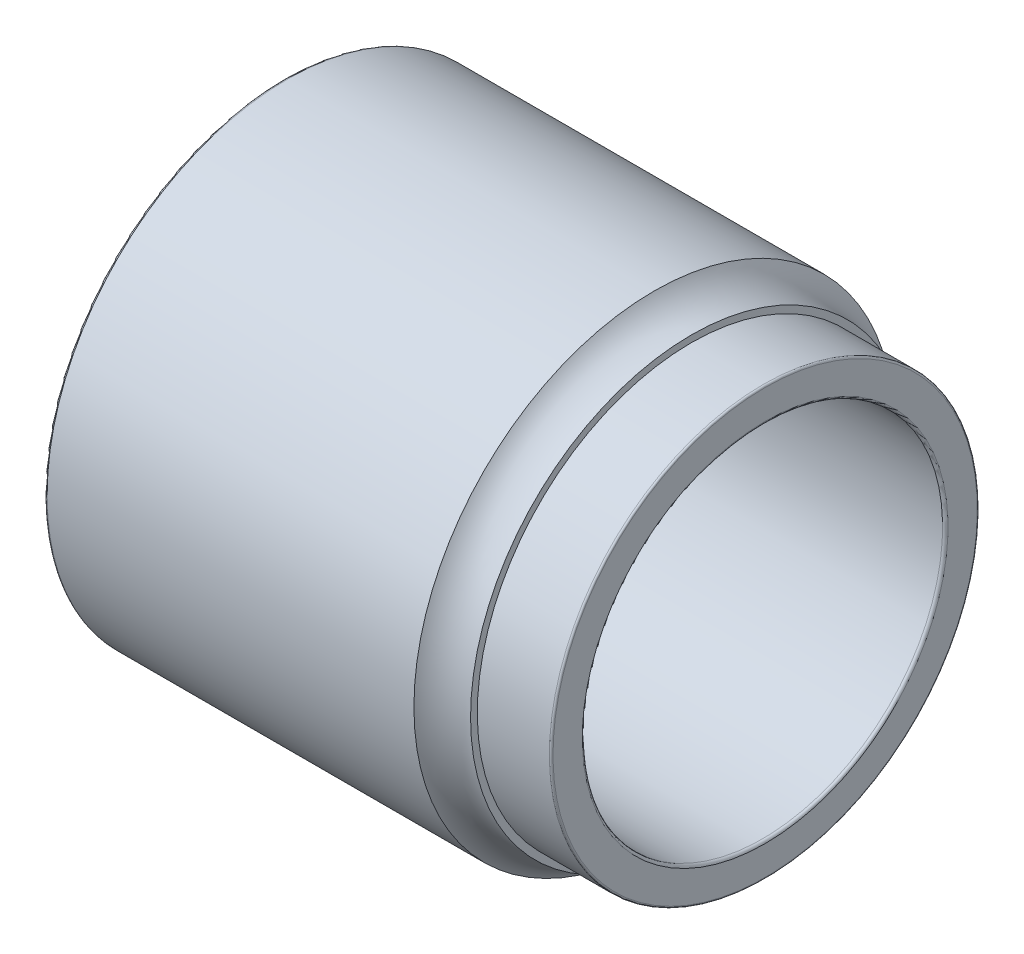
ISO-10303-21;
HEADER;
FILE_DESCRIPTION(('STEP AP214'),'2;1');
FILE_NAME('part.step','',(''),(''),'','','');
FILE_SCHEMA(('AUTOMOTIVE_DESIGN { 1 0 10303 214 1 1 1 1 }'));
ENDSEC;
DATA;
#1=APPLICATION_CONTEXT('core data for automotive mechanical design processes');
#2=APPLICATION_PROTOCOL_DEFINITION('international standard','automotive_design',2000,#1);
#3=PRODUCT_CONTEXT('',#1,'mechanical');
#4=PRODUCT('Part','Part','',(#3));
#5=PRODUCT_RELATED_PRODUCT_CATEGORY('part','',(#4));
#6=PRODUCT_DEFINITION_FORMATION('','',#4);
#7=PRODUCT_DEFINITION_CONTEXT('part definition',#1,'design');
#8=PRODUCT_DEFINITION('design','',#6,#7);
#9=PRODUCT_DEFINITION_SHAPE('','',#8);
#10=(LENGTH_UNIT() NAMED_UNIT(*) SI_UNIT(.MILLI.,.METRE.));
#11=(NAMED_UNIT(*) PLANE_ANGLE_UNIT() SI_UNIT($,.RADIAN.));
#12=(NAMED_UNIT(*) SI_UNIT($,.STERADIAN.) SOLID_ANGLE_UNIT());
#13=UNCERTAINTY_MEASURE_WITH_UNIT(LENGTH_MEASURE(1.E-05),#10,'distance_accuracy_value','');
#14=(GEOMETRIC_REPRESENTATION_CONTEXT(3) GLOBAL_UNCERTAINTY_ASSIGNED_CONTEXT((#13)) GLOBAL_UNIT_ASSIGNED_CONTEXT((#10,
#11,#12)) REPRESENTATION_CONTEXT('',''));
#15=CARTESIAN_POINT('',(0.,0.,0.));
#16=DIRECTION('',(0.,0.,1.));
#17=DIRECTION('',(1.,0.,0.));
#18=AXIS2_PLACEMENT_3D('',#15,#16,#17);
#19=CARTESIAN_POINT('',(15.94,0.,0.));
#20=DIRECTION('',(1.,0.,0.));
#21=DIRECTION('',(0.,0.,-1.));
#22=AXIS2_PLACEMENT_3D('',#19,#20,#21);
#23=TOROIDAL_SURFACE('',#22,7.065,0.06);
#24=CARTESIAN_POINT('',(15.94,0.,0.));
#25=DIRECTION('',(1.,0.,0.));
#26=DIRECTION('',(0.,1.,0.));
#27=AXIS2_PLACEMENT_3D('',#24,#25,#26);
#28=CIRCLE('',#27,7.125);
#29=CARTESIAN_POINT('',(15.94,7.125,0.));
#30=VERTEX_POINT('',#29);
#31=EDGE_CURVE('E11',#30,#30,#28,.T.);
#32=ORIENTED_EDGE('',*,*,#31,.T.);
#33=EDGE_LOOP('',(#32));
#34=FACE_BOUND('',#33,.T.);
#35=CARTESIAN_POINT('',(16.,0.,0.));
#36=DIRECTION('',(1.,0.,0.));
#37=DIRECTION('',(0.,1.,0.));
#38=AXIS2_PLACEMENT_3D('',#35,#36,#37);
#39=CIRCLE('',#38,7.065);
#40=CARTESIAN_POINT('',(16.,7.065,0.));
#41=VERTEX_POINT('',#40);
#42=EDGE_CURVE('E97',#41,#41,#39,.T.);
#43=ORIENTED_EDGE('',*,*,#42,.F.);
#44=EDGE_LOOP('',(#43));
#45=FACE_BOUND('',#44,.T.);
#46=ADVANCED_FACE('F16',(#34,#45),#23,.T.);
#47=CARTESIAN_POINT('',(14.74,0.,0.));
#48=DIRECTION('',(-1.,0.,0.));
#49=DIRECTION('',(0.,1.,0.));
#50=AXIS2_PLACEMENT_3D('',#47,#48,#49);
#51=CYLINDRICAL_SURFACE('',#50,7.125);
#52=CARTESIAN_POINT('',(13.54,0.,0.));
#53=DIRECTION('',(1.,0.,0.));
#54=DIRECTION('',(0.,1.,0.));
#55=AXIS2_PLACEMENT_3D('',#52,#53,#54);
#56=CIRCLE('',#55,7.125);
#57=CARTESIAN_POINT('',(13.54,7.125,0.));
#58=VERTEX_POINT('',#57);
#59=EDGE_CURVE('E25',#58,#58,#56,.T.);
#60=ORIENTED_EDGE('',*,*,#59,.T.);
#61=EDGE_LOOP('',(#60));
#62=FACE_BOUND('',#61,.T.);
#63=ORIENTED_EDGE('',*,*,#31,.F.);
#64=EDGE_LOOP('',(#63));
#65=FACE_BOUND('',#64,.T.);
#66=ADVANCED_FACE('F74',(#62,#65),#51,.T.);
#67=CARTESIAN_POINT('',(13.54,7.2375,0.));
#68=DIRECTION('',(1.,0.,0.));
#69=DIRECTION('',(0.,1.,0.));
#70=AXIS2_PLACEMENT_3D('',#67,#68,#69);
#71=PLANE('',#70);
#72=CARTESIAN_POINT('',(13.54,0.,0.));
#73=DIRECTION('',(1.,0.,0.));
#74=DIRECTION('',(0.,1.,0.));
#75=AXIS2_PLACEMENT_3D('',#72,#73,#74);
#76=CIRCLE('',#75,7.35);
#77=CARTESIAN_POINT('',(13.54,7.35,0.));
#78=VERTEX_POINT('',#77);
#79=EDGE_CURVE('E71',#78,#78,#76,.T.);
#80=ORIENTED_EDGE('',*,*,#79,.T.);
#81=EDGE_LOOP('',(#80));
#82=FACE_BOUND('',#81,.T.);
#83=ORIENTED_EDGE('',*,*,#59,.F.);
#84=EDGE_LOOP('',(#83));
#85=FACE_BOUND('',#84,.T.);
#86=ADVANCED_FACE('F77',(#82,#85),#71,.T.);
#87=CARTESIAN_POINT('',(13.54,0.,0.));
#88=DIRECTION('',(1.,0.,0.));
#89=DIRECTION('',(0.,0.,-1.));
#90=AXIS2_PLACEMENT_3D('',#87,#88,#89);
#91=TOROIDAL_SURFACE('',#90,8.85,1.5);
#92=CARTESIAN_POINT('',(12.3040792905692,0.,0.));
#93=DIRECTION('',(1.,0.,0.));
#94=DIRECTION('',(0.,1.,0.));
#95=AXIS2_PLACEMENT_3D('',#92,#93,#94);
#96=CIRCLE('',#95,8.);
#97=CARTESIAN_POINT('',(12.3040792905692,8.,0.));
#98=VERTEX_POINT('',#97);
#99=EDGE_CURVE('E65',#98,#98,#96,.T.);
#100=ORIENTED_EDGE('',*,*,#99,.T.);
#101=EDGE_LOOP('',(#100));
#102=FACE_BOUND('',#101,.T.);
#103=ORIENTED_EDGE('',*,*,#79,.F.);
#104=EDGE_LOOP('',(#103));
#105=FACE_BOUND('',#104,.T.);
#106=ADVANCED_FACE('F79',(#102,#105),#91,.F.);
#107=CARTESIAN_POINT('',(6.19703964528459,0.,0.));
#108=DIRECTION('',(-1.,0.,0.));
#109=DIRECTION('',(0.,1.,0.));
#110=AXIS2_PLACEMENT_3D('',#107,#108,#109);
#111=CYLINDRICAL_SURFACE('',#110,8.);
#112=CARTESIAN_POINT('',(0.09,0.,0.));
#113=DIRECTION('',(1.,0.,0.));
#114=DIRECTION('',(0.,1.,0.));
#115=AXIS2_PLACEMENT_3D('',#112,#113,#114);
#116=CIRCLE('',#115,8.);
#117=CARTESIAN_POINT('',(0.09,8.,0.));
#118=VERTEX_POINT('',#117);
#119=EDGE_CURVE('E62',#118,#118,#116,.T.);
#120=ORIENTED_EDGE('',*,*,#119,.T.);
#121=EDGE_LOOP('',(#120));
#122=FACE_BOUND('',#121,.T.);
#123=ORIENTED_EDGE('',*,*,#99,.F.);
#124=EDGE_LOOP('',(#123));
#125=FACE_BOUND('',#124,.T.);
#126=ADVANCED_FACE('F87',(#122,#125),#111,.T.);
#127=CARTESIAN_POINT('',(0.09,0.,0.));
#128=DIRECTION('',(1.,0.,0.));
#129=DIRECTION('',(0.,0.,-1.));
#130=AXIS2_PLACEMENT_3D('',#127,#128,#129);
#131=TOROIDAL_SURFACE('',#130,7.91,0.09);
#132=CARTESIAN_POINT('',(0.,0.,0.));
#133=DIRECTION('',(1.,0.,0.));
#134=DIRECTION('',(0.,1.,0.));
#135=AXIS2_PLACEMENT_3D('',#132,#133,#134);
#136=CIRCLE('',#135,7.91);
#137=CARTESIAN_POINT('',(0.,7.91,0.));
#138=VERTEX_POINT('',#137);
#139=EDGE_CURVE('E58',#138,#138,#136,.T.);
#140=ORIENTED_EDGE('',*,*,#139,.T.);
#141=EDGE_LOOP('',(#140));
#142=FACE_BOUND('',#141,.T.);
#143=ORIENTED_EDGE('',*,*,#119,.F.);
#144=EDGE_LOOP('',(#143));
#145=FACE_BOUND('',#144,.T.);
#146=ADVANCED_FACE('F59',(#142,#145),#131,.T.);
#147=CARTESIAN_POINT('',(0.,7.105,0.));
#148=DIRECTION('',(-1.,0.,0.));
#149=DIRECTION('',(0.,-1.,0.));
#150=AXIS2_PLACEMENT_3D('',#147,#148,#149);
#151=PLANE('',#150);
#152=CARTESIAN_POINT('',(0.,0.,0.));
#153=DIRECTION('',(1.,0.,0.));
#154=DIRECTION('',(0.,1.,0.));
#155=AXIS2_PLACEMENT_3D('',#152,#153,#154);
#156=CIRCLE('',#155,6.3);
#157=CARTESIAN_POINT('',(0.,6.3,0.));
#158=VERTEX_POINT('',#157);
#159=EDGE_CURVE('E63',#158,#158,#156,.T.);
#160=ORIENTED_EDGE('',*,*,#159,.T.);
#161=EDGE_LOOP('',(#160));
#162=FACE_BOUND('',#161,.T.);
#163=ORIENTED_EDGE('',*,*,#139,.F.);
#164=EDGE_LOOP('',(#163));
#165=FACE_BOUND('',#164,.T.);
#166=ADVANCED_FACE('F121',(#162,#165),#151,.T.);
#167=CARTESIAN_POINT('',(0.3,0.,0.));
#168=DIRECTION('',(1.,0.,0.));
#169=DIRECTION('',(0.,0.,-1.));
#170=AXIS2_PLACEMENT_3D('',#167,#168,#169);
#171=TOROIDAL_SURFACE('',#170,6.3,0.3);
#172=CARTESIAN_POINT('',(0.3,0.,0.));
#173=DIRECTION('',(1.,0.,0.));
#174=DIRECTION('',(0.,1.,0.));
#175=AXIS2_PLACEMENT_3D('',#172,#173,#174);
#176=CIRCLE('',#175,6.);
#177=CARTESIAN_POINT('',(0.3,6.,0.));
#178=VERTEX_POINT('',#177);
#179=EDGE_CURVE('E67',#178,#178,#176,.T.);
#180=ORIENTED_EDGE('',*,*,#179,.T.);
#181=EDGE_LOOP('',(#180));
#182=FACE_BOUND('',#181,.T.);
#183=ORIENTED_EDGE('',*,*,#159,.F.);
#184=EDGE_LOOP('',(#183));
#185=FACE_BOUND('',#184,.T.);
#186=ADVANCED_FACE('F106',(#182,#185),#171,.T.);
#187=CARTESIAN_POINT('',(8.105,0.,0.));
#188=DIRECTION('',(-1.,0.,0.));
#189=DIRECTION('',(0.,1.,0.));
#190=AXIS2_PLACEMENT_3D('',#187,#188,#189);
#191=CYLINDRICAL_SURFACE('',#190,6.);
#192=CARTESIAN_POINT('',(15.91,0.,0.));
#193=DIRECTION('',(1.,0.,0.));
#194=DIRECTION('',(0.,1.,0.));
#195=AXIS2_PLACEMENT_3D('',#192,#193,#194);
#196=CIRCLE('',#195,6.);
#197=CARTESIAN_POINT('',(15.91,6.,0.));
#198=VERTEX_POINT('',#197);
#199=EDGE_CURVE('E99',#198,#198,#196,.T.);
#200=ORIENTED_EDGE('',*,*,#199,.T.);
#201=EDGE_LOOP('',(#200));
#202=FACE_BOUND('',#201,.T.);
#203=ORIENTED_EDGE('',*,*,#179,.F.);
#204=EDGE_LOOP('',(#203));
#205=FACE_BOUND('',#204,.T.);
#206=ADVANCED_FACE('F109',(#202,#205),#191,.F.);
#207=CARTESIAN_POINT('',(15.91,0.,0.));
#208=DIRECTION('',(1.,0.,0.));
#209=DIRECTION('',(0.,0.,-1.));
#210=AXIS2_PLACEMENT_3D('',#207,#208,#209);
#211=TOROIDAL_SURFACE('',#210,6.09,0.09);
#212=CARTESIAN_POINT('',(16.,0.,0.));
#213=DIRECTION('',(1.,0.,0.));
#214=DIRECTION('',(0.,1.,0.));
#215=AXIS2_PLACEMENT_3D('',#212,#213,#214);
#216=CIRCLE('',#215,6.09);
#217=CARTESIAN_POINT('',(16.,6.09,0.));
#218=VERTEX_POINT('',#217);
#219=EDGE_CURVE('E19',#218,#218,#216,.T.);
#220=ORIENTED_EDGE('',*,*,#219,.T.);
#221=EDGE_LOOP('',(#220));
#222=FACE_BOUND('',#221,.T.);
#223=ORIENTED_EDGE('',*,*,#199,.F.);
#224=EDGE_LOOP('',(#223));
#225=FACE_BOUND('',#224,.T.);
#226=ADVANCED_FACE('F111',(#222,#225),#211,.T.);
#227=CARTESIAN_POINT('',(16.,6.5775,0.));
#228=DIRECTION('',(1.,0.,0.));
#229=DIRECTION('',(0.,1.,0.));
#230=AXIS2_PLACEMENT_3D('',#227,#228,#229);
#231=PLANE('',#230);
#232=ORIENTED_EDGE('',*,*,#42,.T.);
#233=EDGE_LOOP('',(#232));
#234=FACE_BOUND('',#233,.T.);
#235=ORIENTED_EDGE('',*,*,#219,.F.);
#236=EDGE_LOOP('',(#235));
#237=FACE_BOUND('',#236,.T.);
#238=ADVANCED_FACE('F118',(#234,#237),#231,.T.);
#239=CLOSED_SHELL('',(#46,#66,#86,#106,#126,#146,#166,#186,#206,#226,#238));
#240=MANIFOLD_SOLID_BREP('B1',#239);
#241=ADVANCED_BREP_SHAPE_REPRESENTATION('',(#18,#240),#14);
#242=SHAPE_DEFINITION_REPRESENTATION(#9,#241);
ENDSEC;
END-ISO-10303-21;
